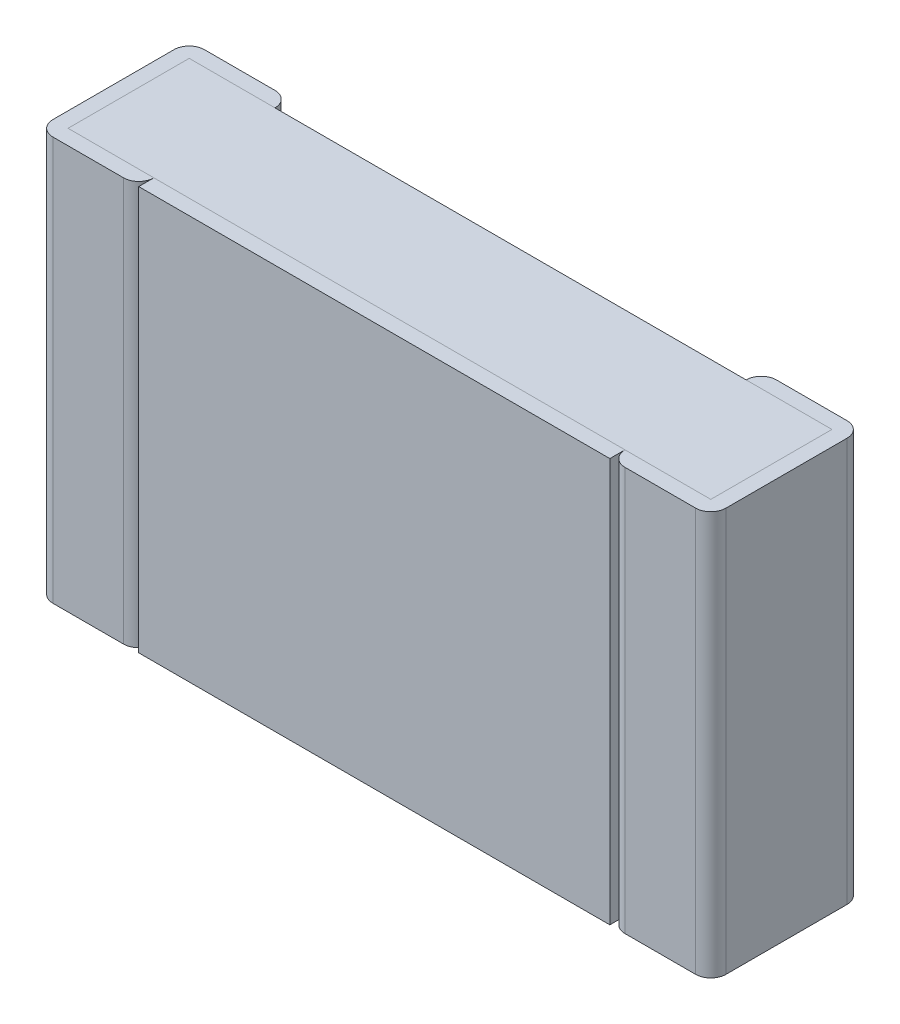
ISO-10303-21;
HEADER;
FILE_DESCRIPTION(('STEP AP214'),'2;1');
FILE_NAME('part.step','',(''),(''),'','','');
FILE_SCHEMA(('AUTOMOTIVE_DESIGN { 1 0 10303 214 1 1 1 1 }'));
ENDSEC;
DATA;
#1=APPLICATION_CONTEXT('core data for automotive mechanical design processes');
#2=APPLICATION_PROTOCOL_DEFINITION('international standard','automotive_design',2000,#1);
#3=PRODUCT_CONTEXT('',#1,'mechanical');
#4=PRODUCT('Part','Part','',(#3));
#5=PRODUCT_RELATED_PRODUCT_CATEGORY('part','',(#4));
#6=PRODUCT_DEFINITION_FORMATION('','',#4);
#7=PRODUCT_DEFINITION_CONTEXT('part definition',#1,'design');
#8=PRODUCT_DEFINITION('design','',#6,#7);
#9=PRODUCT_DEFINITION_SHAPE('','',#8);
#10=(LENGTH_UNIT() NAMED_UNIT(*) SI_UNIT(.MILLI.,.METRE.));
#11=(NAMED_UNIT(*) PLANE_ANGLE_UNIT() SI_UNIT($,.RADIAN.));
#12=(NAMED_UNIT(*) SI_UNIT($,.STERADIAN.) SOLID_ANGLE_UNIT());
#13=UNCERTAINTY_MEASURE_WITH_UNIT(LENGTH_MEASURE(1.E-05),#10,'distance_accuracy_value','');
#14=(GEOMETRIC_REPRESENTATION_CONTEXT(3) GLOBAL_UNCERTAINTY_ASSIGNED_CONTEXT((#13)) GLOBAL_UNIT_ASSIGNED_CONTEXT((#10,
#11,#12)) REPRESENTATION_CONTEXT('',''));
#15=CARTESIAN_POINT('',(0.,0.,0.));
#16=DIRECTION('',(0.,0.,1.));
#17=DIRECTION('',(1.,0.,0.));
#18=AXIS2_PLACEMENT_3D('',#15,#16,#17);
#19=CARTESIAN_POINT('',(-1.,-0.6,0.));
#20=DIRECTION('',(1.,0.,0.));
#21=DIRECTION('',(0.,1.,0.));
#22=AXIS2_PLACEMENT_3D('',#19,#20,#21);
#23=PLANE('',#22);
#24=DIRECTION('',(0.,1.,0.));
#25=VECTOR('',#24,1.);
#26=CARTESIAN_POINT('',(-1.,-0.6,0.405));
#27=LINE('',#26,#25);
#28=CARTESIAN_POINT('',(-1.,-0.6,0.405));
#29=VERTEX_POINT('',#28);
#30=CARTESIAN_POINT('',(-1.,0.6,0.405));
#31=VERTEX_POINT('',#30);
#32=EDGE_CURVE('E11',#29,#31,#27,.T.);
#33=ORIENTED_EDGE('',*,*,#32,.T.);
#34=DIRECTION('',(0.,0.,1.));
#35=VECTOR('',#34,1.);
#36=CARTESIAN_POINT('',(-1.,0.6,0.));
#37=LINE('',#36,#35);
#38=CARTESIAN_POINT('',(-1.,0.6,0.045));
#39=VERTEX_POINT('',#38);
#40=EDGE_CURVE('E41',#39,#31,#37,.T.);
#41=ORIENTED_EDGE('',*,*,#40,.F.);
#42=DIRECTION('',(0.,1.,0.));
#43=VECTOR('',#42,1.);
#44=CARTESIAN_POINT('',(-1.,-0.6,0.045));
#45=LINE('',#44,#43);
#46=CARTESIAN_POINT('',(-1.,-0.6,0.045));
#47=VERTEX_POINT('',#46);
#48=EDGE_CURVE('E371',#47,#39,#45,.T.);
#49=ORIENTED_EDGE('',*,*,#48,.F.);
#50=DIRECTION('',(0.,0.,1.));
#51=VECTOR('',#50,1.);
#52=CARTESIAN_POINT('',(-1.,-0.6,0.));
#53=LINE('',#52,#51);
#54=EDGE_CURVE('E27',#47,#29,#53,.T.);
#55=ORIENTED_EDGE('',*,*,#54,.T.);
#56=EDGE_LOOP('',(#33,#41,#49,#55));
#57=FACE_BOUND('',#56,.T.);
#58=ADVANCED_FACE('F16',(#57),#23,.F.);
#59=CARTESIAN_POINT('',(-1.,-0.6,0.));
#60=DIRECTION('',(0.,1.,0.));
#61=DIRECTION('',(1.,0.,0.));
#62=AXIS2_PLACEMENT_3D('',#59,#60,#61);
#63=PLANE('',#62);
#64=CARTESIAN_POINT('',(-0.745,-0.6,0.045));
#65=DIRECTION('',(0.,1.,0.));
#66=DIRECTION('',(0.,0.,1.));
#67=AXIS2_PLACEMENT_3D('',#64,#65,#66);
#68=CIRCLE('',#67,0.045);
#69=CARTESIAN_POINT('',(-0.7,-0.6,0.045));
#70=VERTEX_POINT('',#69);
#71=CARTESIAN_POINT('',(-0.745,-0.6,0.));
#72=VERTEX_POINT('',#71);
#73=EDGE_CURVE('E314',#70,#72,#68,.T.);
#74=ORIENTED_EDGE('',*,*,#73,.F.);
#75=DIRECTION('',(1.,0.,0.));
#76=VECTOR('',#75,1.);
#77=CARTESIAN_POINT('',(-0.955,-0.6,0.045));
#78=LINE('',#77,#76);
#79=CARTESIAN_POINT('',(-0.955,-0.6,0.045));
#80=VERTEX_POINT('',#79);
#81=EDGE_CURVE('E272',#80,#70,#78,.T.);
#82=ORIENTED_EDGE('',*,*,#81,.F.);
#83=DIRECTION('',(0.,0.,1.));
#84=VECTOR('',#83,1.);
#85=CARTESIAN_POINT('',(-0.955,-0.6,0.045));
#86=LINE('',#85,#84);
#87=CARTESIAN_POINT('',(-0.955,-0.6,0.405));
#88=VERTEX_POINT('',#87);
#89=EDGE_CURVE('E302',#80,#88,#86,.T.);
#90=ORIENTED_EDGE('',*,*,#89,.T.);
#91=DIRECTION('',(1.,0.,0.));
#92=VECTOR('',#91,1.);
#93=CARTESIAN_POINT('',(-0.955,-0.6,0.405));
#94=LINE('',#93,#92);
#95=CARTESIAN_POINT('',(-0.7,-0.6,0.405));
#96=VERTEX_POINT('',#95);
#97=EDGE_CURVE('E359',#88,#96,#94,.T.);
#98=ORIENTED_EDGE('',*,*,#97,.T.);
#99=CARTESIAN_POINT('',(-0.745,-0.6,0.405));
#100=DIRECTION('',(0.,-1.,0.));
#101=DIRECTION('',(0.,0.,1.));
#102=AXIS2_PLACEMENT_3D('',#99,#100,#101);
#103=CIRCLE('',#102,0.045);
#104=CARTESIAN_POINT('',(-0.745,-0.6,0.45));
#105=VERTEX_POINT('',#104);
#106=EDGE_CURVE('E350',#96,#105,#103,.T.);
#107=ORIENTED_EDGE('',*,*,#106,.T.);
#108=DIRECTION('',(1.,0.,0.));
#109=VECTOR('',#108,1.);
#110=CARTESIAN_POINT('',(-1.,-0.6,0.45));
#111=LINE('',#110,#109);
#112=CARTESIAN_POINT('',(-0.955,-0.6,0.45));
#113=VERTEX_POINT('',#112);
#114=EDGE_CURVE('E275',#113,#105,#111,.T.);
#115=ORIENTED_EDGE('',*,*,#114,.F.);
#116=CARTESIAN_POINT('',(-0.955,-0.6,0.405));
#117=DIRECTION('',(0.,1.,0.));
#118=DIRECTION('',(0.,0.,1.));
#119=AXIS2_PLACEMENT_3D('',#116,#117,#118);
#120=CIRCLE('',#119,0.045);
#121=EDGE_CURVE('E319',#29,#113,#120,.T.);
#122=ORIENTED_EDGE('',*,*,#121,.F.);
#123=ORIENTED_EDGE('',*,*,#54,.F.);
#124=CARTESIAN_POINT('',(-0.955,-0.6,0.045));
#125=DIRECTION('',(0.,-1.,0.));
#126=DIRECTION('',(0.,0.,1.));
#127=AXIS2_PLACEMENT_3D('',#124,#125,#126);
#128=CIRCLE('',#127,0.045);
#129=CARTESIAN_POINT('',(-0.955,-0.6,0.));
#130=VERTEX_POINT('',#129);
#131=EDGE_CURVE('E346',#47,#130,#128,.T.);
#132=ORIENTED_EDGE('',*,*,#131,.T.);
#133=DIRECTION('',(1.,0.,0.));
#134=VECTOR('',#133,1.);
#135=CARTESIAN_POINT('',(-1.,-0.6,0.));
#136=LINE('',#135,#134);
#137=EDGE_CURVE('E351',#130,#72,#136,.T.);
#138=ORIENTED_EDGE('',*,*,#137,.T.);
#139=EDGE_LOOP('',(#74,#82,#90,#98,#107,#115,#122,#123,#132,#138));
#140=FACE_BOUND('',#139,.T.);
#141=ADVANCED_FACE('F427',(#140),#63,.F.);
#142=CARTESIAN_POINT('',(-0.955,-0.6,0.045));
#143=DIRECTION('',(0.,1.,0.));
#144=DIRECTION('',(-1.,0.,0.));
#145=AXIS2_PLACEMENT_3D('',#142,#143,#144);
#146=CYLINDRICAL_SURFACE('',#145,0.045);
#147=ORIENTED_EDGE('',*,*,#48,.T.);
#148=CARTESIAN_POINT('',(-0.955,0.6,0.045));
#149=DIRECTION('',(0.,-1.,0.));
#150=DIRECTION('',(0.,0.,1.));
#151=AXIS2_PLACEMENT_3D('',#148,#149,#150);
#152=CIRCLE('',#151,0.045);
#153=CARTESIAN_POINT('',(-0.955,0.6,0.));
#154=VERTEX_POINT('',#153);
#155=EDGE_CURVE('E323',#39,#154,#152,.T.);
#156=ORIENTED_EDGE('',*,*,#155,.T.);
#157=DIRECTION('',(0.,1.,0.));
#158=VECTOR('',#157,1.);
#159=CARTESIAN_POINT('',(-0.955,-0.6,0.));
#160=LINE('',#159,#158);
#161=EDGE_CURVE('E375',#130,#154,#160,.T.);
#162=ORIENTED_EDGE('',*,*,#161,.F.);
#163=ORIENTED_EDGE('',*,*,#131,.F.);
#164=EDGE_LOOP('',(#147,#156,#162,#163));
#165=FACE_BOUND('',#164,.T.);
#166=ADVANCED_FACE('F433',(#165),#146,.T.);
#167=CARTESIAN_POINT('',(-0.955,-0.6,0.405));
#168=DIRECTION('',(0.,1.,0.));
#169=DIRECTION('',(-1.,0.,0.));
#170=AXIS2_PLACEMENT_3D('',#167,#168,#169);
#171=CYLINDRICAL_SURFACE('',#170,0.045);
#172=ORIENTED_EDGE('',*,*,#121,.T.);
#173=DIRECTION('',(0.,1.,0.));
#174=VECTOR('',#173,1.);
#175=CARTESIAN_POINT('',(-0.955,-0.6,0.45));
#176=LINE('',#175,#174);
#177=CARTESIAN_POINT('',(-0.955,0.6,0.45));
#178=VERTEX_POINT('',#177);
#179=EDGE_CURVE('E324',#113,#178,#176,.T.);
#180=ORIENTED_EDGE('',*,*,#179,.T.);
#181=CARTESIAN_POINT('',(-0.955,0.6,0.405));
#182=DIRECTION('',(0.,1.,0.));
#183=DIRECTION('',(0.,0.,1.));
#184=AXIS2_PLACEMENT_3D('',#181,#182,#183);
#185=CIRCLE('',#184,0.045);
#186=EDGE_CURVE('E336',#31,#178,#185,.T.);
#187=ORIENTED_EDGE('',*,*,#186,.F.);
#188=ORIENTED_EDGE('',*,*,#32,.F.);
#189=EDGE_LOOP('',(#172,#180,#187,#188));
#190=FACE_BOUND('',#189,.T.);
#191=ADVANCED_FACE('F583',(#190),#171,.T.);
#192=CARTESIAN_POINT('',(-1.,0.6,0.));
#193=DIRECTION('',(0.,1.,0.));
#194=DIRECTION('',(1.,0.,0.));
#195=AXIS2_PLACEMENT_3D('',#192,#193,#194);
#196=PLANE('',#195);
#197=DIRECTION('',(1.,0.,0.));
#198=VECTOR('',#197,1.);
#199=CARTESIAN_POINT('',(-1.,0.6,0.));
#200=LINE('',#199,#198);
#201=CARTESIAN_POINT('',(-0.745,0.6,0.));
#202=VERTEX_POINT('',#201);
#203=EDGE_CURVE('E317',#154,#202,#200,.T.);
#204=ORIENTED_EDGE('',*,*,#203,.F.);
#205=ORIENTED_EDGE('',*,*,#155,.F.);
#206=ORIENTED_EDGE('',*,*,#40,.T.);
#207=ORIENTED_EDGE('',*,*,#186,.T.);
#208=DIRECTION('',(1.,0.,0.));
#209=VECTOR('',#208,1.);
#210=CARTESIAN_POINT('',(-1.,0.6,0.45));
#211=LINE('',#210,#209);
#212=CARTESIAN_POINT('',(-0.745,0.6,0.45));
#213=VERTEX_POINT('',#212);
#214=EDGE_CURVE('E332',#178,#213,#211,.T.);
#215=ORIENTED_EDGE('',*,*,#214,.T.);
#216=CARTESIAN_POINT('',(-0.745,0.6,0.405));
#217=DIRECTION('',(0.,-1.,0.));
#218=DIRECTION('',(0.,0.,1.));
#219=AXIS2_PLACEMENT_3D('',#216,#217,#218);
#220=CIRCLE('',#219,0.045);
#221=CARTESIAN_POINT('',(-0.7,0.6,0.405));
#222=VERTEX_POINT('',#221);
#223=EDGE_CURVE('E295',#222,#213,#220,.T.);
#224=ORIENTED_EDGE('',*,*,#223,.F.);
#225=DIRECTION('',(1.,0.,0.));
#226=VECTOR('',#225,1.);
#227=CARTESIAN_POINT('',(-0.955,0.6,0.405));
#228=LINE('',#227,#226);
#229=CARTESIAN_POINT('',(-0.955,0.6,0.405));
#230=VERTEX_POINT('',#229);
#231=EDGE_CURVE('E20',#230,#222,#228,.T.);
#232=ORIENTED_EDGE('',*,*,#231,.F.);
#233=DIRECTION('',(0.,0.,1.));
#234=VECTOR('',#233,1.);
#235=CARTESIAN_POINT('',(-0.955,0.6,0.045));
#236=LINE('',#235,#234);
#237=CARTESIAN_POINT('',(-0.955,0.6,0.045));
#238=VERTEX_POINT('',#237);
#239=EDGE_CURVE('E299',#238,#230,#236,.T.);
#240=ORIENTED_EDGE('',*,*,#239,.F.);
#241=DIRECTION('',(1.,0.,0.));
#242=VECTOR('',#241,1.);
#243=CARTESIAN_POINT('',(-0.955,0.6,0.045));
#244=LINE('',#243,#242);
#245=CARTESIAN_POINT('',(-0.7,0.6,0.045));
#246=VERTEX_POINT('',#245);
#247=EDGE_CURVE('E337',#238,#246,#244,.T.);
#248=ORIENTED_EDGE('',*,*,#247,.T.);
#249=CARTESIAN_POINT('',(-0.745,0.6,0.045));
#250=DIRECTION('',(0.,1.,0.));
#251=DIRECTION('',(0.,0.,1.));
#252=AXIS2_PLACEMENT_3D('',#249,#250,#251);
#253=CIRCLE('',#252,0.045);
#254=EDGE_CURVE('E378',#246,#202,#253,.T.);
#255=ORIENTED_EDGE('',*,*,#254,.T.);
#256=EDGE_LOOP('',(#204,#205,#206,#207,#215,#224,#232,#240,#248,#255));
#257=FACE_BOUND('',#256,.T.);
#258=ADVANCED_FACE('F418',(#257),#196,.T.);
#259=CARTESIAN_POINT('',(-1.,-0.6,0.));
#260=DIRECTION('',(0.,0.,1.));
#261=DIRECTION('',(1.,0.,0.));
#262=AXIS2_PLACEMENT_3D('',#259,#260,#261);
#263=PLANE('',#262);
#264=DIRECTION('',(0.,1.,0.));
#265=VECTOR('',#264,1.);
#266=CARTESIAN_POINT('',(-0.745,-0.6,0.));
#267=LINE('',#266,#265);
#268=EDGE_CURVE('E318',#72,#202,#267,.T.);
#269=ORIENTED_EDGE('',*,*,#268,.F.);
#270=ORIENTED_EDGE('',*,*,#137,.F.);
#271=ORIENTED_EDGE('',*,*,#161,.T.);
#272=ORIENTED_EDGE('',*,*,#203,.T.);
#273=EDGE_LOOP('',(#269,#270,#271,#272));
#274=FACE_BOUND('',#273,.T.);
#275=ADVANCED_FACE('F414',(#274),#263,.F.);
#276=CARTESIAN_POINT('',(-0.745,-0.6,0.045));
#277=DIRECTION('',(0.,1.,0.));
#278=DIRECTION('',(1.,0.,0.));
#279=AXIS2_PLACEMENT_3D('',#276,#277,#278);
#280=CYLINDRICAL_SURFACE('',#279,0.045);
#281=ORIENTED_EDGE('',*,*,#73,.T.);
#282=ORIENTED_EDGE('',*,*,#268,.T.);
#283=ORIENTED_EDGE('',*,*,#254,.F.);
#284=DIRECTION('',(0.,1.,0.));
#285=VECTOR('',#284,1.);
#286=CARTESIAN_POINT('',(-0.7,-0.6,0.045));
#287=LINE('',#286,#285);
#288=EDGE_CURVE('E290',#70,#246,#287,.T.);
#289=ORIENTED_EDGE('',*,*,#288,.F.);
#290=EDGE_LOOP('',(#281,#282,#283,#289));
#291=FACE_BOUND('',#290,.T.);
#292=ADVANCED_FACE('F423',(#291),#280,.T.);
#293=CARTESIAN_POINT('',(-0.955,-0.6,0.045));
#294=DIRECTION('',(0.,1.,0.));
#295=DIRECTION('',(1.,0.,0.));
#296=AXIS2_PLACEMENT_3D('',#293,#294,#295);
#297=PLANE('',#296);
#298=DIRECTION('',(1.,0.,0.));
#299=VECTOR('',#298,1.);
#300=CARTESIAN_POINT('',(-0.955,-0.6,0.045));
#301=LINE('',#300,#299);
#302=CARTESIAN_POINT('',(0.7,-0.6,0.045));
#303=VERTEX_POINT('',#302);
#304=EDGE_CURVE('E328',#70,#303,#301,.T.);
#305=ORIENTED_EDGE('',*,*,#304,.T.);
#306=DIRECTION('',(1.,0.,0.));
#307=VECTOR('',#306,1.);
#308=CARTESIAN_POINT('',(-0.955,-0.6,0.045));
#309=LINE('',#308,#307);
#310=CARTESIAN_POINT('',(0.955,-0.6,0.045));
#311=VERTEX_POINT('',#310);
#312=EDGE_CURVE('E331',#303,#311,#309,.T.);
#313=ORIENTED_EDGE('',*,*,#312,.T.);
#314=DIRECTION('',(0.,0.,1.));
#315=VECTOR('',#314,1.);
#316=CARTESIAN_POINT('',(0.955,-0.6,0.045));
#317=LINE('',#316,#315);
#318=CARTESIAN_POINT('',(0.955,-0.6,0.405));
#319=VERTEX_POINT('',#318);
#320=EDGE_CURVE('E247',#311,#319,#317,.T.);
#321=ORIENTED_EDGE('',*,*,#320,.T.);
#322=DIRECTION('',(1.,0.,0.));
#323=VECTOR('',#322,1.);
#324=CARTESIAN_POINT('',(-0.955,-0.6,0.405));
#325=LINE('',#324,#323);
#326=CARTESIAN_POINT('',(0.7,-0.6,0.405));
#327=VERTEX_POINT('',#326);
#328=EDGE_CURVE('E208',#327,#319,#325,.T.);
#329=ORIENTED_EDGE('',*,*,#328,.F.);
#330=DIRECTION('',(1.,0.,0.));
#331=VECTOR('',#330,1.);
#332=CARTESIAN_POINT('',(-0.7,-0.6,0.405));
#333=LINE('',#332,#331);
#334=EDGE_CURVE('E222',#96,#327,#333,.T.);
#335=ORIENTED_EDGE('',*,*,#334,.F.);
#336=ORIENTED_EDGE('',*,*,#97,.F.);
#337=ORIENTED_EDGE('',*,*,#89,.F.);
#338=ORIENTED_EDGE('',*,*,#81,.T.);
#339=EDGE_LOOP('',(#305,#313,#321,#329,#335,#336,#337,#338));
#340=FACE_BOUND('',#339,.T.);
#341=ADVANCED_FACE('F246',(#340),#297,.F.);
#342=CARTESIAN_POINT('',(-1.,-0.6,0.45));
#343=DIRECTION('',(0.,0.,1.));
#344=DIRECTION('',(1.,0.,0.));
#345=AXIS2_PLACEMENT_3D('',#342,#343,#344);
#346=PLANE('',#345);
#347=ORIENTED_EDGE('',*,*,#214,.F.);
#348=ORIENTED_EDGE('',*,*,#179,.F.);
#349=ORIENTED_EDGE('',*,*,#114,.T.);
#350=DIRECTION('',(0.,1.,0.));
#351=VECTOR('',#350,1.);
#352=CARTESIAN_POINT('',(-0.745,-0.6,0.45));
#353=LINE('',#352,#351);
#354=EDGE_CURVE('E294',#105,#213,#353,.T.);
#355=ORIENTED_EDGE('',*,*,#354,.T.);
#356=EDGE_LOOP('',(#347,#348,#349,#355));
#357=FACE_BOUND('',#356,.T.);
#358=ADVANCED_FACE('F537',(#357),#346,.T.);
#359=CARTESIAN_POINT('',(-0.745,-0.6,0.405));
#360=DIRECTION('',(0.,1.,0.));
#361=DIRECTION('',(1.,0.,0.));
#362=AXIS2_PLACEMENT_3D('',#359,#360,#361);
#363=CYLINDRICAL_SURFACE('',#362,0.045);
#364=DIRECTION('',(0.,1.,0.));
#365=VECTOR('',#364,1.);
#366=CARTESIAN_POINT('',(-0.7,-0.6,0.405));
#367=LINE('',#366,#365);
#368=EDGE_CURVE('E298',#96,#222,#367,.T.);
#369=ORIENTED_EDGE('',*,*,#368,.T.);
#370=ORIENTED_EDGE('',*,*,#223,.T.);
#371=ORIENTED_EDGE('',*,*,#354,.F.);
#372=ORIENTED_EDGE('',*,*,#106,.F.);
#373=EDGE_LOOP('',(#369,#370,#371,#372));
#374=FACE_BOUND('',#373,.T.);
#375=ADVANCED_FACE('F513',(#374),#363,.T.);
#376=CARTESIAN_POINT('',(-0.955,0.6,0.045));
#377=DIRECTION('',(0.,1.,0.));
#378=DIRECTION('',(1.,0.,0.));
#379=AXIS2_PLACEMENT_3D('',#376,#377,#378);
#380=PLANE('',#379);
#381=ORIENTED_EDGE('',*,*,#247,.F.);
#382=ORIENTED_EDGE('',*,*,#239,.T.);
#383=ORIENTED_EDGE('',*,*,#231,.T.);
#384=DIRECTION('',(1.,0.,0.));
#385=VECTOR('',#384,1.);
#386=CARTESIAN_POINT('',(-0.7,0.6,0.405));
#387=LINE('',#386,#385);
#388=CARTESIAN_POINT('',(0.7,0.6,0.405));
#389=VERTEX_POINT('',#388);
#390=EDGE_CURVE('E482',#222,#389,#387,.T.);
#391=ORIENTED_EDGE('',*,*,#390,.T.);
#392=DIRECTION('',(1.,0.,0.));
#393=VECTOR('',#392,1.);
#394=CARTESIAN_POINT('',(-0.955,0.6,0.405));
#395=LINE('',#394,#393);
#396=CARTESIAN_POINT('',(0.955,0.6,0.405));
#397=VERTEX_POINT('',#396);
#398=EDGE_CURVE('E480',#389,#397,#395,.T.);
#399=ORIENTED_EDGE('',*,*,#398,.T.);
#400=DIRECTION('',(0.,0.,1.));
#401=VECTOR('',#400,1.);
#402=CARTESIAN_POINT('',(0.955,0.6,0.045));
#403=LINE('',#402,#401);
#404=CARTESIAN_POINT('',(0.955,0.6,0.045));
#405=VERTEX_POINT('',#404);
#406=EDGE_CURVE('E276',#405,#397,#403,.T.);
#407=ORIENTED_EDGE('',*,*,#406,.F.);
#408=DIRECTION('',(1.,0.,0.));
#409=VECTOR('',#408,1.);
#410=CARTESIAN_POINT('',(-0.955,0.6,0.045));
#411=LINE('',#410,#409);
#412=CARTESIAN_POINT('',(0.7,0.6,0.045));
#413=VERTEX_POINT('',#412);
#414=EDGE_CURVE('E280',#413,#405,#411,.T.);
#415=ORIENTED_EDGE('',*,*,#414,.F.);
#416=DIRECTION('',(1.,0.,0.));
#417=VECTOR('',#416,1.);
#418=CARTESIAN_POINT('',(-0.955,0.6,0.045));
#419=LINE('',#418,#417);
#420=EDGE_CURVE('E445',#246,#413,#419,.T.);
#421=ORIENTED_EDGE('',*,*,#420,.F.);
#422=EDGE_LOOP('',(#381,#382,#383,#391,#399,#407,#415,#421));
#423=FACE_BOUND('',#422,.T.);
#424=ADVANCED_FACE('F507',(#423),#380,.T.);
#425=CARTESIAN_POINT('',(-0.955,-0.6,0.045));
#426=DIRECTION('',(0.,0.,1.));
#427=DIRECTION('',(1.,0.,0.));
#428=AXIS2_PLACEMENT_3D('',#425,#426,#427);
#429=PLANE('',#428);
#430=ORIENTED_EDGE('',*,*,#420,.T.);
#431=DIRECTION('',(0.,1.,0.));
#432=VECTOR('',#431,1.);
#433=CARTESIAN_POINT('',(0.7,-0.6,0.045));
#434=LINE('',#433,#432);
#435=EDGE_CURVE('E345',#303,#413,#434,.T.);
#436=ORIENTED_EDGE('',*,*,#435,.F.);
#437=ORIENTED_EDGE('',*,*,#304,.F.);
#438=ORIENTED_EDGE('',*,*,#288,.T.);
#439=EDGE_LOOP('',(#430,#436,#437,#438));
#440=FACE_BOUND('',#439,.T.);
#441=ADVANCED_FACE('F558',(#440),#429,.F.);
#442=CARTESIAN_POINT('',(0.7,-0.6,0.));
#443=DIRECTION('',(0.,1.,0.));
#444=DIRECTION('',(1.,0.,0.));
#445=AXIS2_PLACEMENT_3D('',#442,#443,#444);
#446=PLANE('',#445);
#447=CARTESIAN_POINT('',(0.955,-0.6,0.045));
#448=DIRECTION('',(0.,1.,0.));
#449=DIRECTION('',(0.,0.,1.));
#450=AXIS2_PLACEMENT_3D('',#447,#448,#449);
#451=CIRCLE('',#450,0.045);
#452=CARTESIAN_POINT('',(1.,-0.6,0.045));
#453=VERTEX_POINT('',#452);
#454=CARTESIAN_POINT('',(0.955,-0.6,0.));
#455=VERTEX_POINT('',#454);
#456=EDGE_CURVE('E285',#453,#455,#451,.T.);
#457=ORIENTED_EDGE('',*,*,#456,.F.);
#458=DIRECTION('',(0.,0.,1.));
#459=VECTOR('',#458,1.);
#460=CARTESIAN_POINT('',(1.,-0.6,0.));
#461=LINE('',#460,#459);
#462=CARTESIAN_POINT('',(1.,-0.6,0.405));
#463=VERTEX_POINT('',#462);
#464=EDGE_CURVE('E286',#453,#463,#461,.T.);
#465=ORIENTED_EDGE('',*,*,#464,.T.);
#466=CARTESIAN_POINT('',(0.955,-0.6,0.405));
#467=DIRECTION('',(0.,-1.,0.));
#468=DIRECTION('',(0.,0.,1.));
#469=AXIS2_PLACEMENT_3D('',#466,#467,#468);
#470=CIRCLE('',#469,0.045);
#471=CARTESIAN_POINT('',(0.955,-0.6,0.45));
#472=VERTEX_POINT('',#471);
#473=EDGE_CURVE('E249',#463,#472,#470,.T.);
#474=ORIENTED_EDGE('',*,*,#473,.T.);
#475=DIRECTION('',(1.,0.,0.));
#476=VECTOR('',#475,1.);
#477=CARTESIAN_POINT('',(0.7,-0.6,0.45));
#478=LINE('',#477,#476);
#479=CARTESIAN_POINT('',(0.745,-0.6,0.45));
#480=VERTEX_POINT('',#479);
#481=EDGE_CURVE('E210',#480,#472,#478,.T.);
#482=ORIENTED_EDGE('',*,*,#481,.F.);
#483=CARTESIAN_POINT('',(0.745,-0.6,0.405));
#484=DIRECTION('',(0.,1.,0.));
#485=DIRECTION('',(0.,0.,1.));
#486=AXIS2_PLACEMENT_3D('',#483,#484,#485);
#487=CIRCLE('',#486,0.045);
#488=EDGE_CURVE('E203',#327,#480,#487,.T.);
#489=ORIENTED_EDGE('',*,*,#488,.F.);
#490=ORIENTED_EDGE('',*,*,#328,.T.);
#491=ORIENTED_EDGE('',*,*,#320,.F.);
#492=ORIENTED_EDGE('',*,*,#312,.F.);
#493=CARTESIAN_POINT('',(0.745,-0.6,0.045));
#494=DIRECTION('',(0.,-1.,0.));
#495=DIRECTION('',(0.,0.,1.));
#496=AXIS2_PLACEMENT_3D('',#493,#494,#495);
#497=CIRCLE('',#496,0.045);
#498=CARTESIAN_POINT('',(0.745,-0.6,0.));
#499=VERTEX_POINT('',#498);
#500=EDGE_CURVE('E250',#303,#499,#497,.T.);
#501=ORIENTED_EDGE('',*,*,#500,.T.);
#502=DIRECTION('',(1.,0.,0.));
#503=VECTOR('',#502,1.);
#504=CARTESIAN_POINT('',(0.7,-0.6,0.));
#505=LINE('',#504,#503);
#506=EDGE_CURVE('E243',#499,#455,#505,.T.);
#507=ORIENTED_EDGE('',*,*,#506,.T.);
#508=EDGE_LOOP('',(#457,#465,#474,#482,#489,#490,#491,#492,#501,#507));
#509=FACE_BOUND('',#508,.T.);
#510=ADVANCED_FACE('F205',(#509),#446,.F.);
#511=CARTESIAN_POINT('',(-0.7,-0.6,0.405));
#512=DIRECTION('',(0.,1.,0.));
#513=DIRECTION('',(1.,0.,0.));
#514=AXIS2_PLACEMENT_3D('',#511,#512,#513);
#515=PLANE('',#514);
#516=DIRECTION('',(0.,0.,1.));
#517=VECTOR('',#516,1.);
#518=CARTESIAN_POINT('',(0.7,-0.6,0.405));
#519=LINE('',#518,#517);
#520=CARTESIAN_POINT('',(0.7,-0.6,0.45));
#521=VERTEX_POINT('',#520);
#522=EDGE_CURVE('E226',#327,#521,#519,.T.);
#523=ORIENTED_EDGE('',*,*,#522,.T.);
#524=DIRECTION('',(1.,0.,0.));
#525=VECTOR('',#524,1.);
#526=CARTESIAN_POINT('',(-0.7,-0.6,0.45));
#527=LINE('',#526,#525);
#528=CARTESIAN_POINT('',(-0.7,-0.6,0.45));
#529=VERTEX_POINT('',#528);
#530=EDGE_CURVE('E266',#529,#521,#527,.T.);
#531=ORIENTED_EDGE('',*,*,#530,.F.);
#532=DIRECTION('',(0.,0.,1.));
#533=VECTOR('',#532,1.);
#534=CARTESIAN_POINT('',(-0.7,-0.6,0.405));
#535=LINE('',#534,#533);
#536=EDGE_CURVE('E229',#96,#529,#535,.T.);
#537=ORIENTED_EDGE('',*,*,#536,.F.);
#538=ORIENTED_EDGE('',*,*,#334,.T.);
#539=EDGE_LOOP('',(#523,#531,#537,#538));
#540=FACE_BOUND('',#539,.T.);
#541=ADVANCED_FACE('F224',(#540),#515,.F.);
#542=CARTESIAN_POINT('',(-0.7,-0.6,0.405));
#543=DIRECTION('',(1.,0.,0.));
#544=DIRECTION('',(0.,1.,0.));
#545=AXIS2_PLACEMENT_3D('',#542,#543,#544);
#546=PLANE('',#545);
#547=DIRECTION('',(0.,1.,0.));
#548=VECTOR('',#547,1.);
#549=CARTESIAN_POINT('',(-0.7,-0.6,0.45));
#550=LINE('',#549,#548);
#551=CARTESIAN_POINT('',(-0.7,0.6,0.45));
#552=VERTEX_POINT('',#551);
#553=EDGE_CURVE('E234',#529,#552,#550,.T.);
#554=ORIENTED_EDGE('',*,*,#553,.T.);
#555=DIRECTION('',(0.,0.,1.));
#556=VECTOR('',#555,1.);
#557=CARTESIAN_POINT('',(-0.7,0.6,0.405));
#558=LINE('',#557,#556);
#559=EDGE_CURVE('E313',#222,#552,#558,.T.);
#560=ORIENTED_EDGE('',*,*,#559,.F.);
#561=ORIENTED_EDGE('',*,*,#368,.F.);
#562=ORIENTED_EDGE('',*,*,#536,.T.);
#563=EDGE_LOOP('',(#554,#560,#561,#562));
#564=FACE_BOUND('',#563,.T.);
#565=ADVANCED_FACE('F515',(#564),#546,.F.);
#566=CARTESIAN_POINT('',(0.7,0.6,0.));
#567=DIRECTION('',(0.,1.,0.));
#568=DIRECTION('',(1.,0.,0.));
#569=AXIS2_PLACEMENT_3D('',#566,#567,#568);
#570=PLANE('',#569);
#571=DIRECTION('',(1.,0.,0.));
#572=VECTOR('',#571,1.);
#573=CARTESIAN_POINT('',(0.7,0.6,0.));
#574=LINE('',#573,#572);
#575=CARTESIAN_POINT('',(0.745,0.6,0.));
#576=VERTEX_POINT('',#575);
#577=CARTESIAN_POINT('',(0.955,0.6,0.));
#578=VERTEX_POINT('',#577);
#579=EDGE_CURVE('E281',#576,#578,#574,.T.);
#580=ORIENTED_EDGE('',*,*,#579,.F.);
#581=CARTESIAN_POINT('',(0.745,0.6,0.045));
#582=DIRECTION('',(0.,-1.,0.));
#583=DIRECTION('',(0.,0.,1.));
#584=AXIS2_PLACEMENT_3D('',#581,#582,#583);
#585=CIRCLE('',#584,0.045);
#586=EDGE_CURVE('E379',#413,#576,#585,.T.);
#587=ORIENTED_EDGE('',*,*,#586,.F.);
#588=ORIENTED_EDGE('',*,*,#414,.T.);
#589=ORIENTED_EDGE('',*,*,#406,.T.);
#590=ORIENTED_EDGE('',*,*,#398,.F.);
#591=CARTESIAN_POINT('',(0.745,0.6,0.405));
#592=DIRECTION('',(0.,1.,0.));
#593=DIRECTION('',(0.,0.,1.));
#594=AXIS2_PLACEMENT_3D('',#591,#592,#593);
#595=CIRCLE('',#594,0.045);
#596=CARTESIAN_POINT('',(0.745,0.6,0.45));
#597=VERTEX_POINT('',#596);
#598=EDGE_CURVE('E255',#389,#597,#595,.T.);
#599=ORIENTED_EDGE('',*,*,#598,.T.);
#600=DIRECTION('',(1.,0.,0.));
#601=VECTOR('',#600,1.);
#602=CARTESIAN_POINT('',(0.7,0.6,0.45));
#603=LINE('',#602,#601);
#604=CARTESIAN_POINT('',(0.955,0.6,0.45));
#605=VERTEX_POINT('',#604);
#606=EDGE_CURVE('E312',#597,#605,#603,.T.);
#607=ORIENTED_EDGE('',*,*,#606,.T.);
#608=CARTESIAN_POINT('',(0.955,0.6,0.405));
#609=DIRECTION('',(0.,-1.,0.));
#610=DIRECTION('',(0.,0.,1.));
#611=AXIS2_PLACEMENT_3D('',#608,#609,#610);
#612=CIRCLE('',#611,0.045);
#613=CARTESIAN_POINT('',(1.,0.6,0.405));
#614=VERTEX_POINT('',#613);
#615=EDGE_CURVE('E270',#614,#605,#612,.T.);
#616=ORIENTED_EDGE('',*,*,#615,.F.);
#617=DIRECTION('',(0.,0.,1.));
#618=VECTOR('',#617,1.);
#619=CARTESIAN_POINT('',(1.,0.6,0.));
#620=LINE('',#619,#618);
#621=CARTESIAN_POINT('',(1.,0.6,0.045));
#622=VERTEX_POINT('',#621);
#623=EDGE_CURVE('E307',#622,#614,#620,.T.);
#624=ORIENTED_EDGE('',*,*,#623,.F.);
#625=CARTESIAN_POINT('',(0.955,0.6,0.045));
#626=DIRECTION('',(0.,1.,0.));
#627=DIRECTION('',(0.,0.,1.));
#628=AXIS2_PLACEMENT_3D('',#625,#626,#627);
#629=CIRCLE('',#628,0.045);
#630=EDGE_CURVE('E308',#622,#578,#629,.T.);
#631=ORIENTED_EDGE('',*,*,#630,.T.);
#632=EDGE_LOOP('',(#580,#587,#588,#589,#590,#599,#607,#616,#624,#631));
#633=FACE_BOUND('',#632,.T.);
#634=ADVANCED_FACE('F545',(#633),#570,.T.);
#635=CARTESIAN_POINT('',(-0.7,0.6,0.405));
#636=DIRECTION('',(0.,1.,0.));
#637=DIRECTION('',(1.,0.,0.));
#638=AXIS2_PLACEMENT_3D('',#635,#636,#637);
#639=PLANE('',#638);
#640=ORIENTED_EDGE('',*,*,#390,.F.);
#641=ORIENTED_EDGE('',*,*,#559,.T.);
#642=DIRECTION('',(1.,0.,0.));
#643=VECTOR('',#642,1.);
#644=CARTESIAN_POINT('',(-0.7,0.6,0.45));
#645=LINE('',#644,#643);
#646=CARTESIAN_POINT('',(0.7,0.6,0.45));
#647=VERTEX_POINT('',#646);
#648=EDGE_CURVE('E341',#552,#647,#645,.T.);
#649=ORIENTED_EDGE('',*,*,#648,.T.);
#650=DIRECTION('',(0.,0.,1.));
#651=VECTOR('',#650,1.);
#652=CARTESIAN_POINT('',(0.7,0.6,0.405));
#653=LINE('',#652,#651);
#654=EDGE_CURVE('E258',#389,#647,#653,.T.);
#655=ORIENTED_EDGE('',*,*,#654,.F.);
#656=EDGE_LOOP('',(#640,#641,#649,#655));
#657=FACE_BOUND('',#656,.T.);
#658=ADVANCED_FACE('F519',(#657),#639,.T.);
#659=CARTESIAN_POINT('',(0.745,-0.6,0.045));
#660=DIRECTION('',(0.,1.,0.));
#661=DIRECTION('',(-1.,0.,0.));
#662=AXIS2_PLACEMENT_3D('',#659,#660,#661);
#663=CYLINDRICAL_SURFACE('',#662,0.045);
#664=ORIENTED_EDGE('',*,*,#435,.T.);
#665=ORIENTED_EDGE('',*,*,#586,.T.);
#666=DIRECTION('',(0.,1.,0.));
#667=VECTOR('',#666,1.);
#668=CARTESIAN_POINT('',(0.745,-0.6,0.));
#669=LINE('',#668,#667);
#670=EDGE_CURVE('E284',#499,#576,#669,.T.);
#671=ORIENTED_EDGE('',*,*,#670,.F.);
#672=ORIENTED_EDGE('',*,*,#500,.F.);
#673=EDGE_LOOP('',(#664,#665,#671,#672));
#674=FACE_BOUND('',#673,.T.);
#675=ADVANCED_FACE('F541',(#674),#663,.T.);
#676=CARTESIAN_POINT('',(0.7,-0.6,0.));
#677=DIRECTION('',(0.,0.,1.));
#678=DIRECTION('',(1.,0.,0.));
#679=AXIS2_PLACEMENT_3D('',#676,#677,#678);
#680=PLANE('',#679);
#681=DIRECTION('',(0.,1.,0.));
#682=VECTOR('',#681,1.);
#683=CARTESIAN_POINT('',(0.955,-0.6,0.));
#684=LINE('',#683,#682);
#685=EDGE_CURVE('E340',#455,#578,#684,.T.);
#686=ORIENTED_EDGE('',*,*,#685,.F.);
#687=ORIENTED_EDGE('',*,*,#506,.F.);
#688=ORIENTED_EDGE('',*,*,#670,.T.);
#689=ORIENTED_EDGE('',*,*,#579,.T.);
#690=EDGE_LOOP('',(#686,#687,#688,#689));
#691=FACE_BOUND('',#690,.T.);
#692=ADVANCED_FACE('F470',(#691),#680,.F.);
#693=CARTESIAN_POINT('',(0.955,-0.6,0.045));
#694=DIRECTION('',(0.,1.,0.));
#695=DIRECTION('',(1.,0.,0.));
#696=AXIS2_PLACEMENT_3D('',#693,#694,#695);
#697=CYLINDRICAL_SURFACE('',#696,0.045);
#698=ORIENTED_EDGE('',*,*,#456,.T.);
#699=ORIENTED_EDGE('',*,*,#685,.T.);
#700=ORIENTED_EDGE('',*,*,#630,.F.);
#701=DIRECTION('',(0.,1.,0.));
#702=VECTOR('',#701,1.);
#703=CARTESIAN_POINT('',(1.,-0.6,0.045));
#704=LINE('',#703,#702);
#705=EDGE_CURVE('E358',#453,#622,#704,.T.);
#706=ORIENTED_EDGE('',*,*,#705,.F.);
#707=EDGE_LOOP('',(#698,#699,#700,#706));
#708=FACE_BOUND('',#707,.T.);
#709=ADVANCED_FACE('F547',(#708),#697,.T.);
#710=CARTESIAN_POINT('',(1.,-0.6,0.));
#711=DIRECTION('',(1.,0.,0.));
#712=DIRECTION('',(0.,1.,0.));
#713=AXIS2_PLACEMENT_3D('',#710,#711,#712);
#714=PLANE('',#713);
#715=ORIENTED_EDGE('',*,*,#464,.F.);
#716=ORIENTED_EDGE('',*,*,#705,.T.);
#717=ORIENTED_EDGE('',*,*,#623,.T.);
#718=DIRECTION('',(0.,1.,0.));
#719=VECTOR('',#718,1.);
#720=CARTESIAN_POINT('',(1.,-0.6,0.405));
#721=LINE('',#720,#719);
#722=EDGE_CURVE('E303',#463,#614,#721,.T.);
#723=ORIENTED_EDGE('',*,*,#722,.F.);
#724=EDGE_LOOP('',(#715,#716,#717,#723));
#725=FACE_BOUND('',#724,.T.);
#726=ADVANCED_FACE('F549',(#725),#714,.T.);
#727=CARTESIAN_POINT('',(0.955,-0.6,0.405));
#728=DIRECTION('',(0.,1.,0.));
#729=DIRECTION('',(1.,0.,0.));
#730=AXIS2_PLACEMENT_3D('',#727,#728,#729);
#731=CYLINDRICAL_SURFACE('',#730,0.045);
#732=ORIENTED_EDGE('',*,*,#722,.T.);
#733=ORIENTED_EDGE('',*,*,#615,.T.);
#734=DIRECTION('',(0.,1.,0.));
#735=VECTOR('',#734,1.);
#736=CARTESIAN_POINT('',(0.955,-0.6,0.45));
#737=LINE('',#736,#735);
#738=EDGE_CURVE('E216',#472,#605,#737,.T.);
#739=ORIENTED_EDGE('',*,*,#738,.F.);
#740=ORIENTED_EDGE('',*,*,#473,.F.);
#741=EDGE_LOOP('',(#732,#733,#739,#740));
#742=FACE_BOUND('',#741,.T.);
#743=ADVANCED_FACE('F18',(#742),#731,.T.);
#744=CARTESIAN_POINT('',(0.7,-0.6,0.45));
#745=DIRECTION('',(0.,0.,1.));
#746=DIRECTION('',(1.,0.,0.));
#747=AXIS2_PLACEMENT_3D('',#744,#745,#746);
#748=PLANE('',#747);
#749=ORIENTED_EDGE('',*,*,#606,.F.);
#750=DIRECTION('',(0.,1.,0.));
#751=VECTOR('',#750,1.);
#752=CARTESIAN_POINT('',(0.745,-0.6,0.45));
#753=LINE('',#752,#751);
#754=EDGE_CURVE('E217',#480,#597,#753,.T.);
#755=ORIENTED_EDGE('',*,*,#754,.F.);
#756=ORIENTED_EDGE('',*,*,#481,.T.);
#757=ORIENTED_EDGE('',*,*,#738,.T.);
#758=EDGE_LOOP('',(#749,#755,#756,#757));
#759=FACE_BOUND('',#758,.T.);
#760=ADVANCED_FACE('F554',(#759),#748,.T.);
#761=CARTESIAN_POINT('',(0.745,-0.6,0.405));
#762=DIRECTION('',(0.,1.,0.));
#763=DIRECTION('',(-1.,0.,0.));
#764=AXIS2_PLACEMENT_3D('',#761,#762,#763);
#765=CYLINDRICAL_SURFACE('',#764,0.045);
#766=ORIENTED_EDGE('',*,*,#488,.T.);
#767=ORIENTED_EDGE('',*,*,#754,.T.);
#768=ORIENTED_EDGE('',*,*,#598,.F.);
#769=DIRECTION('',(0.,1.,0.));
#770=VECTOR('',#769,1.);
#771=CARTESIAN_POINT('',(0.7,-0.6,0.405));
#772=LINE('',#771,#770);
#773=EDGE_CURVE('E239',#327,#389,#772,.T.);
#774=ORIENTED_EDGE('',*,*,#773,.F.);
#775=EDGE_LOOP('',(#766,#767,#768,#774));
#776=FACE_BOUND('',#775,.T.);
#777=ADVANCED_FACE('F253',(#776),#765,.T.);
#778=CARTESIAN_POINT('',(0.7,-0.6,0.405));
#779=DIRECTION('',(1.,0.,0.));
#780=DIRECTION('',(0.,1.,0.));
#781=AXIS2_PLACEMENT_3D('',#778,#779,#780);
#782=PLANE('',#781);
#783=ORIENTED_EDGE('',*,*,#522,.F.);
#784=ORIENTED_EDGE('',*,*,#773,.T.);
#785=ORIENTED_EDGE('',*,*,#654,.T.);
#786=DIRECTION('',(0.,1.,0.));
#787=VECTOR('',#786,1.);
#788=CARTESIAN_POINT('',(0.7,-0.6,0.45));
#789=LINE('',#788,#787);
#790=EDGE_CURVE('E241',#521,#647,#789,.T.);
#791=ORIENTED_EDGE('',*,*,#790,.F.);
#792=EDGE_LOOP('',(#783,#784,#785,#791));
#793=FACE_BOUND('',#792,.T.);
#794=ADVANCED_FACE('F238',(#793),#782,.T.);
#795=CARTESIAN_POINT('',(-0.7,-0.6,0.45));
#796=DIRECTION('',(0.,0.,1.));
#797=DIRECTION('',(1.,0.,0.));
#798=AXIS2_PLACEMENT_3D('',#795,#796,#797);
#799=PLANE('',#798);
#800=ORIENTED_EDGE('',*,*,#553,.F.);
#801=ORIENTED_EDGE('',*,*,#530,.T.);
#802=ORIENTED_EDGE('',*,*,#790,.T.);
#803=ORIENTED_EDGE('',*,*,#648,.F.);
#804=EDGE_LOOP('',(#800,#801,#802,#803));
#805=FACE_BOUND('',#804,.T.);
#806=ADVANCED_FACE('F521',(#805),#799,.T.);
#807=CLOSED_SHELL('',(#58,#141,#166,#191,#258,#275,#292,#341,#358,#375,#424,#441,#510,#541,#565,
#634,#658,#675,#692,#709,#726,#743,#760,#777,#794,#806));
#808=MANIFOLD_SOLID_BREP('B1',#807);
#809=ADVANCED_BREP_SHAPE_REPRESENTATION('',(#18,#808),#14);
#810=SHAPE_DEFINITION_REPRESENTATION(#9,#809);
ENDSEC;
END-ISO-10303-21;
